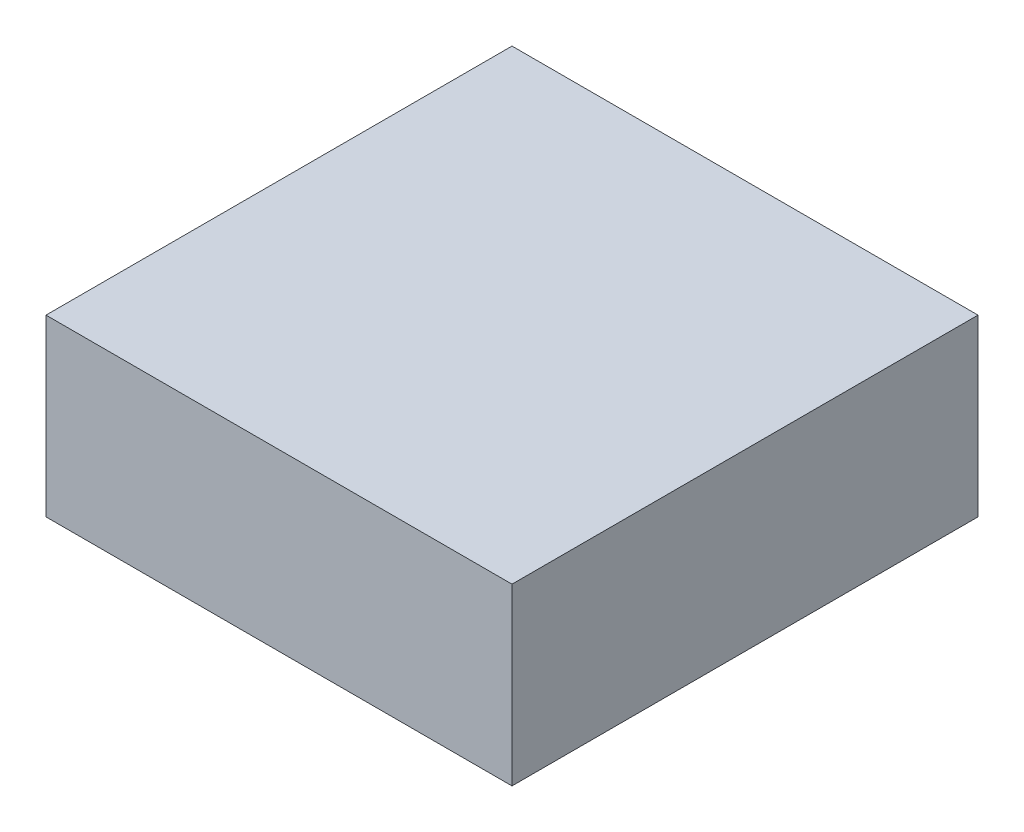
ISO-10303-21;
HEADER;
FILE_DESCRIPTION(('STEP AP214'),'2;1');
FILE_NAME('part.step','',(''),(''),'','','');
FILE_SCHEMA(('AUTOMOTIVE_DESIGN { 1 0 10303 214 1 1 1 1 }'));
ENDSEC;
DATA;
#1=APPLICATION_CONTEXT('core data for automotive mechanical design processes');
#2=APPLICATION_PROTOCOL_DEFINITION('international standard','automotive_design',2000,#1);
#3=PRODUCT_CONTEXT('',#1,'mechanical');
#4=PRODUCT('Part','Part','',(#3));
#5=PRODUCT_RELATED_PRODUCT_CATEGORY('part','',(#4));
#6=PRODUCT_DEFINITION_FORMATION('','',#4);
#7=PRODUCT_DEFINITION_CONTEXT('part definition',#1,'design');
#8=PRODUCT_DEFINITION('design','',#6,#7);
#9=PRODUCT_DEFINITION_SHAPE('','',#8);
#10=(LENGTH_UNIT() NAMED_UNIT(*) SI_UNIT(.MILLI.,.METRE.));
#11=(NAMED_UNIT(*) PLANE_ANGLE_UNIT() SI_UNIT($,.RADIAN.));
#12=(NAMED_UNIT(*) SI_UNIT($,.STERADIAN.) SOLID_ANGLE_UNIT());
#13=UNCERTAINTY_MEASURE_WITH_UNIT(LENGTH_MEASURE(1.E-05),#10,'distance_accuracy_value','');
#14=(GEOMETRIC_REPRESENTATION_CONTEXT(3) GLOBAL_UNCERTAINTY_ASSIGNED_CONTEXT((#13)) GLOBAL_UNIT_ASSIGNED_CONTEXT((#10,
#11,#12)) REPRESENTATION_CONTEXT('',''));
#15=CARTESIAN_POINT('',(0.,0.,0.));
#16=DIRECTION('',(0.,0.,1.));
#17=DIRECTION('',(1.,0.,0.));
#18=AXIS2_PLACEMENT_3D('',#15,#16,#17);
#19=CARTESIAN_POINT('',(0.,19.05,0.));
#20=DIRECTION('',(-1.,0.,0.));
#21=DIRECTION('',(0.,0.,1.));
#22=AXIS2_PLACEMENT_3D('',#19,#20,#21);
#23=PLANE('',#22);
#24=DIRECTION('',(0.,0.,-1.));
#25=VECTOR('',#24,1.);
#26=CARTESIAN_POINT('',(0.,0.,0.));
#27=LINE('',#26,#25);
#28=CARTESIAN_POINT('',(0.,0.,0.));
#29=VERTEX_POINT('',#28);
#30=CARTESIAN_POINT('',(0.,0.,-50.8));
#31=VERTEX_POINT('',#30);
#32=EDGE_CURVE('E95',#29,#31,#27,.T.);
#33=ORIENTED_EDGE('',*,*,#32,.T.);
#34=DIRECTION('',(0.,-1.,0.));
#35=VECTOR('',#34,1.);
#36=CARTESIAN_POINT('',(0.,19.05,-50.8));
#37=LINE('',#36,#35);
#38=CARTESIAN_POINT('',(0.,19.05,-50.8));
#39=VERTEX_POINT('',#38);
#40=EDGE_CURVE('E11',#39,#31,#37,.T.);
#41=ORIENTED_EDGE('',*,*,#40,.F.);
#42=DIRECTION('',(0.,0.,-1.));
#43=VECTOR('',#42,1.);
#44=CARTESIAN_POINT('',(0.,19.05,0.));
#45=LINE('',#44,#43);
#46=CARTESIAN_POINT('',(0.,19.05,0.));
#47=VERTEX_POINT('',#46);
#48=EDGE_CURVE('E83',#47,#39,#45,.T.);
#49=ORIENTED_EDGE('',*,*,#48,.F.);
#50=DIRECTION('',(0.,-1.,0.));
#51=VECTOR('',#50,1.);
#52=CARTESIAN_POINT('',(0.,19.05,0.));
#53=LINE('',#52,#51);
#54=EDGE_CURVE('E91',#47,#29,#53,.T.);
#55=ORIENTED_EDGE('',*,*,#54,.T.);
#56=EDGE_LOOP('',(#33,#41,#49,#55));
#57=FACE_BOUND('',#56,.T.);
#58=ADVANCED_FACE('F32',(#57),#23,.F.);
#59=CARTESIAN_POINT('',(0.,19.05,-50.8));
#60=DIRECTION('',(0.,0.,1.));
#61=DIRECTION('',(1.,0.,0.));
#62=AXIS2_PLACEMENT_3D('',#59,#60,#61);
#63=PLANE('',#62);
#64=DIRECTION('',(-1.,0.,0.));
#65=VECTOR('',#64,1.);
#66=CARTESIAN_POINT('',(0.,0.,-50.8));
#67=LINE('',#66,#65);
#68=CARTESIAN_POINT('',(-50.8,0.,-50.8));
#69=VERTEX_POINT('',#68);
#70=EDGE_CURVE('E87',#31,#69,#67,.T.);
#71=ORIENTED_EDGE('',*,*,#70,.T.);
#72=DIRECTION('',(0.,-1.,0.));
#73=VECTOR('',#72,1.);
#74=CARTESIAN_POINT('',(-50.8,19.05,-50.8));
#75=LINE('',#74,#73);
#76=CARTESIAN_POINT('',(-50.8,19.05,-50.8));
#77=VERTEX_POINT('',#76);
#78=EDGE_CURVE('E40',#77,#69,#75,.T.);
#79=ORIENTED_EDGE('',*,*,#78,.F.);
#80=DIRECTION('',(-1.,0.,0.));
#81=VECTOR('',#80,1.);
#82=CARTESIAN_POINT('',(0.,19.05,-50.8));
#83=LINE('',#82,#81);
#84=EDGE_CURVE('E78',#39,#77,#83,.T.);
#85=ORIENTED_EDGE('',*,*,#84,.F.);
#86=ORIENTED_EDGE('',*,*,#40,.T.);
#87=EDGE_LOOP('',(#71,#79,#85,#86));
#88=FACE_BOUND('',#87,.T.);
#89=ADVANCED_FACE('F86',(#88),#63,.F.);
#90=CARTESIAN_POINT('',(-50.8,19.05,0.));
#91=DIRECTION('',(1.,0.,0.));
#92=DIRECTION('',(0.,0.,-1.));
#93=AXIS2_PLACEMENT_3D('',#90,#91,#92);
#94=PLANE('',#93);
#95=DIRECTION('',(0.,0.,1.));
#96=VECTOR('',#95,1.);
#97=CARTESIAN_POINT('',(-50.8,0.,0.));
#98=LINE('',#97,#96);
#99=CARTESIAN_POINT('',(-50.8,0.,0.));
#100=VERTEX_POINT('',#99);
#101=EDGE_CURVE('E65',#69,#100,#98,.T.);
#102=ORIENTED_EDGE('',*,*,#101,.T.);
#103=DIRECTION('',(0.,-1.,0.));
#104=VECTOR('',#103,1.);
#105=CARTESIAN_POINT('',(-50.8,19.05,0.));
#106=LINE('',#105,#104);
#107=CARTESIAN_POINT('',(-50.8,19.05,0.));
#108=VERTEX_POINT('',#107);
#109=EDGE_CURVE('E88',#108,#100,#106,.T.);
#110=ORIENTED_EDGE('',*,*,#109,.F.);
#111=DIRECTION('',(0.,0.,1.));
#112=VECTOR('',#111,1.);
#113=CARTESIAN_POINT('',(-50.8,19.05,0.));
#114=LINE('',#113,#112);
#115=EDGE_CURVE('E81',#77,#108,#114,.T.);
#116=ORIENTED_EDGE('',*,*,#115,.F.);
#117=ORIENTED_EDGE('',*,*,#78,.T.);
#118=EDGE_LOOP('',(#102,#110,#116,#117));
#119=FACE_BOUND('',#118,.T.);
#120=ADVANCED_FACE('F89',(#119),#94,.F.);
#121=CARTESIAN_POINT('',(0.,19.05,0.));
#122=DIRECTION('',(0.,0.,-1.));
#123=DIRECTION('',(-1.,0.,0.));
#124=AXIS2_PLACEMENT_3D('',#121,#122,#123);
#125=PLANE('',#124);
#126=DIRECTION('',(1.,0.,0.));
#127=VECTOR('',#126,1.);
#128=CARTESIAN_POINT('',(0.,0.,0.));
#129=LINE('',#128,#127);
#130=EDGE_CURVE('E71',#100,#29,#129,.T.);
#131=ORIENTED_EDGE('',*,*,#130,.T.);
#132=ORIENTED_EDGE('',*,*,#54,.F.);
#133=DIRECTION('',(1.,0.,0.));
#134=VECTOR('',#133,1.);
#135=CARTESIAN_POINT('',(0.,19.05,0.));
#136=LINE('',#135,#134);
#137=EDGE_CURVE('E48',#108,#47,#136,.T.);
#138=ORIENTED_EDGE('',*,*,#137,.F.);
#139=ORIENTED_EDGE('',*,*,#109,.T.);
#140=EDGE_LOOP('',(#131,#132,#138,#139));
#141=FACE_BOUND('',#140,.T.);
#142=ADVANCED_FACE('F102',(#141),#125,.F.);
#143=CARTESIAN_POINT('',(0.,19.05,0.));
#144=DIRECTION('',(0.,1.,0.));
#145=DIRECTION('',(0.,0.,1.));
#146=AXIS2_PLACEMENT_3D('',#143,#144,#145);
#147=PLANE('',#146);
#148=ORIENTED_EDGE('',*,*,#48,.T.);
#149=ORIENTED_EDGE('',*,*,#84,.T.);
#150=ORIENTED_EDGE('',*,*,#115,.T.);
#151=ORIENTED_EDGE('',*,*,#137,.T.);
#152=EDGE_LOOP('',(#148,#149,#150,#151));
#153=FACE_BOUND('',#152,.T.);
#154=ADVANCED_FACE('F79',(#153),#147,.T.);
#155=CARTESIAN_POINT('',(0.,0.,0.));
#156=DIRECTION('',(0.,1.,0.));
#157=DIRECTION('',(0.,0.,1.));
#158=AXIS2_PLACEMENT_3D('',#155,#156,#157);
#159=PLANE('',#158);
#160=ORIENTED_EDGE('',*,*,#32,.F.);
#161=ORIENTED_EDGE('',*,*,#130,.F.);
#162=ORIENTED_EDGE('',*,*,#101,.F.);
#163=ORIENTED_EDGE('',*,*,#70,.F.);
#164=EDGE_LOOP('',(#160,#161,#162,#163));
#165=FACE_BOUND('',#164,.T.);
#166=ADVANCED_FACE('F105',(#165),#159,.F.);
#167=CLOSED_SHELL('',(#58,#89,#120,#142,#154,#166));
#168=MANIFOLD_SOLID_BREP('B2',#167);
#169=ADVANCED_BREP_SHAPE_REPRESENTATION('',(#18,#168),#14);
#170=SHAPE_DEFINITION_REPRESENTATION(#9,#169);
ENDSEC;
END-ISO-10303-21;
